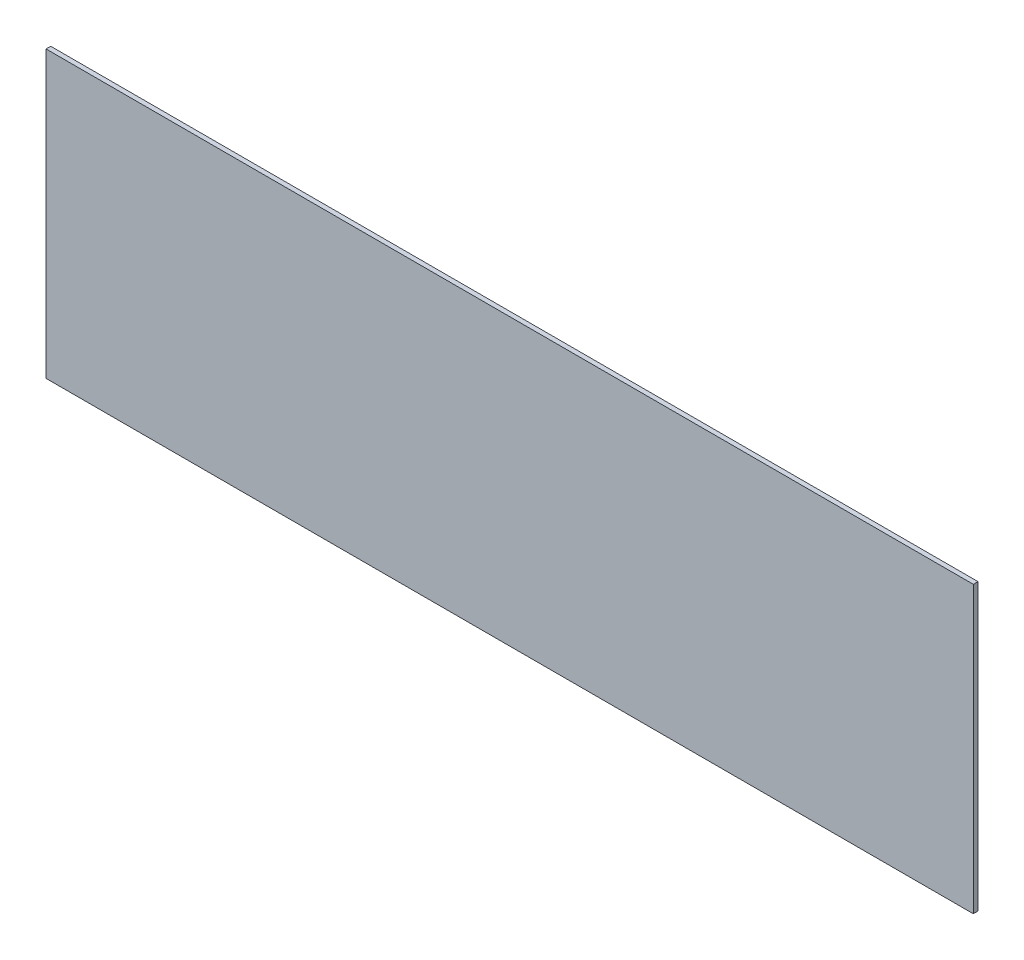
ISO-10303-21;
HEADER;
FILE_DESCRIPTION(('STEP AP214'),'2;1');
FILE_NAME('part.step','',(''),(''),'','','');
FILE_SCHEMA(('AUTOMOTIVE_DESIGN { 1 0 10303 214 1 1 1 1 }'));
ENDSEC;
DATA;
#1=APPLICATION_CONTEXT('core data for automotive mechanical design processes');
#2=APPLICATION_PROTOCOL_DEFINITION('international standard','automotive_design',2000,#1);
#3=PRODUCT_CONTEXT('',#1,'mechanical');
#4=PRODUCT('Part','Part','',(#3));
#5=PRODUCT_RELATED_PRODUCT_CATEGORY('part','',(#4));
#6=PRODUCT_DEFINITION_FORMATION('','',#4);
#7=PRODUCT_DEFINITION_CONTEXT('part definition',#1,'design');
#8=PRODUCT_DEFINITION('design','',#6,#7);
#9=PRODUCT_DEFINITION_SHAPE('','',#8);
#10=(LENGTH_UNIT() NAMED_UNIT(*) SI_UNIT(.MILLI.,.METRE.));
#11=(NAMED_UNIT(*) PLANE_ANGLE_UNIT() SI_UNIT($,.RADIAN.));
#12=(NAMED_UNIT(*) SI_UNIT($,.STERADIAN.) SOLID_ANGLE_UNIT());
#13=UNCERTAINTY_MEASURE_WITH_UNIT(LENGTH_MEASURE(1.E-05),#10,'distance_accuracy_value','');
#14=(GEOMETRIC_REPRESENTATION_CONTEXT(3) GLOBAL_UNCERTAINTY_ASSIGNED_CONTEXT((#13)) GLOBAL_UNIT_ASSIGNED_CONTEXT((#10,
#11,#12)) REPRESENTATION_CONTEXT('',''));
#15=CARTESIAN_POINT('',(0.,0.,0.));
#16=DIRECTION('',(0.,0.,1.));
#17=DIRECTION('',(1.,0.,0.));
#18=AXIS2_PLACEMENT_3D('',#15,#16,#17);
#19=CARTESIAN_POINT('',(0.,0.,0.41656));
#20=DIRECTION('',(0.,0.,1.));
#21=DIRECTION('',(1.,0.,0.));
#22=AXIS2_PLACEMENT_3D('',#19,#20,#21);
#23=PLANE('',#22);
#24=DIRECTION('',(1.,0.,0.));
#25=VECTOR('',#24,1.);
#26=CARTESIAN_POINT('',(0.,25.4,0.41656));
#27=LINE('',#26,#25);
#28=CARTESIAN_POINT('',(0.,25.4,0.41656));
#29=VERTEX_POINT('',#28);
#30=CARTESIAN_POINT('',(82.55,25.4,0.41656));
#31=VERTEX_POINT('',#30);
#32=EDGE_CURVE('E53',#29,#31,#27,.T.);
#33=ORIENTED_EDGE('',*,*,#32,.F.);
#34=DIRECTION('',(0.,1.,0.));
#35=VECTOR('',#34,1.);
#36=CARTESIAN_POINT('',(0.,0.,0.41656));
#37=LINE('',#36,#35);
#38=CARTESIAN_POINT('',(0.,0.,0.41656));
#39=VERTEX_POINT('',#38);
#40=EDGE_CURVE('E68',#39,#29,#37,.T.);
#41=ORIENTED_EDGE('',*,*,#40,.F.);
#42=DIRECTION('',(1.,0.,0.));
#43=VECTOR('',#42,1.);
#44=CARTESIAN_POINT('',(82.55,0.,0.41656));
#45=LINE('',#44,#43);
#46=CARTESIAN_POINT('',(82.55,0.,0.41656));
#47=VERTEX_POINT('',#46);
#48=EDGE_CURVE('E20',#47,#39,#45,.F.);
#49=ORIENTED_EDGE('',*,*,#48,.F.);
#50=DIRECTION('',(0.,1.,0.));
#51=VECTOR('',#50,1.);
#52=CARTESIAN_POINT('',(82.55,25.4,0.41656));
#53=LINE('',#52,#51);
#54=EDGE_CURVE('E58',#31,#47,#53,.F.);
#55=ORIENTED_EDGE('',*,*,#54,.F.);
#56=EDGE_LOOP('',(#33,#41,#49,#55));
#57=FACE_BOUND('',#56,.T.);
#58=ADVANCED_FACE('F17',(#57),#23,.T.);
#59=CARTESIAN_POINT('',(82.55,0.,0.));
#60=DIRECTION('',(0.,-1.,0.));
#61=DIRECTION('',(0.,0.,-1.));
#62=AXIS2_PLACEMENT_3D('',#59,#60,#61);
#63=PLANE('',#62);
#64=DIRECTION('',(0.,0.,1.));
#65=VECTOR('',#64,1.);
#66=CARTESIAN_POINT('',(0.,0.,0.));
#67=LINE('',#66,#65);
#68=CARTESIAN_POINT('',(0.,0.,0.));
#69=VERTEX_POINT('',#68);
#70=EDGE_CURVE('E79',#69,#39,#67,.T.);
#71=ORIENTED_EDGE('',*,*,#70,.F.);
#72=DIRECTION('',(1.,0.,0.));
#73=VECTOR('',#72,1.);
#74=CARTESIAN_POINT('',(0.,0.,0.));
#75=LINE('',#74,#73);
#76=CARTESIAN_POINT('',(82.55,0.,0.));
#77=VERTEX_POINT('',#76);
#78=EDGE_CURVE('E74',#69,#77,#75,.T.);
#79=ORIENTED_EDGE('',*,*,#78,.T.);
#80=DIRECTION('',(0.,0.,-1.));
#81=VECTOR('',#80,1.);
#82=CARTESIAN_POINT('',(82.55,0.,0.));
#83=LINE('',#82,#81);
#84=EDGE_CURVE('E63',#47,#77,#83,.T.);
#85=ORIENTED_EDGE('',*,*,#84,.F.);
#86=ORIENTED_EDGE('',*,*,#48,.T.);
#87=EDGE_LOOP('',(#71,#79,#85,#86));
#88=FACE_BOUND('',#87,.T.);
#89=ADVANCED_FACE('F73',(#88),#63,.T.);
#90=CARTESIAN_POINT('',(82.55,25.4,0.));
#91=DIRECTION('',(1.,0.,0.));
#92=DIRECTION('',(0.,0.,-1.));
#93=AXIS2_PLACEMENT_3D('',#90,#91,#92);
#94=PLANE('',#93);
#95=ORIENTED_EDGE('',*,*,#84,.T.);
#96=DIRECTION('',(0.,1.,0.));
#97=VECTOR('',#96,1.);
#98=CARTESIAN_POINT('',(82.55,0.,0.));
#99=LINE('',#98,#97);
#100=CARTESIAN_POINT('',(82.55,25.4,0.));
#101=VERTEX_POINT('',#100);
#102=EDGE_CURVE('E84',#77,#101,#99,.T.);
#103=ORIENTED_EDGE('',*,*,#102,.T.);
#104=DIRECTION('',(0.,0.,1.));
#105=VECTOR('',#104,1.);
#106=CARTESIAN_POINT('',(82.55,25.4,0.));
#107=LINE('',#106,#105);
#108=EDGE_CURVE('E65',#31,#101,#107,.F.);
#109=ORIENTED_EDGE('',*,*,#108,.F.);
#110=ORIENTED_EDGE('',*,*,#54,.T.);
#111=EDGE_LOOP('',(#95,#103,#109,#110));
#112=FACE_BOUND('',#111,.T.);
#113=ADVANCED_FACE('F60',(#112),#94,.T.);
#114=CARTESIAN_POINT('',(0.,25.4,0.));
#115=DIRECTION('',(0.,1.,0.));
#116=DIRECTION('',(0.,0.,1.));
#117=AXIS2_PLACEMENT_3D('',#114,#115,#116);
#118=PLANE('',#117);
#119=ORIENTED_EDGE('',*,*,#108,.T.);
#120=DIRECTION('',(1.,0.,0.));
#121=VECTOR('',#120,1.);
#122=CARTESIAN_POINT('',(0.,25.4,0.));
#123=LINE('',#122,#121);
#124=CARTESIAN_POINT('',(0.,25.4,0.));
#125=VERTEX_POINT('',#124);
#126=EDGE_CURVE('E26',#101,#125,#123,.F.);
#127=ORIENTED_EDGE('',*,*,#126,.T.);
#128=DIRECTION('',(0.,0.,1.));
#129=VECTOR('',#128,1.);
#130=CARTESIAN_POINT('',(0.,25.4,0.));
#131=LINE('',#130,#129);
#132=EDGE_CURVE('E34',#29,#125,#131,.F.);
#133=ORIENTED_EDGE('',*,*,#132,.F.);
#134=ORIENTED_EDGE('',*,*,#32,.T.);
#135=EDGE_LOOP('',(#119,#127,#133,#134));
#136=FACE_BOUND('',#135,.T.);
#137=ADVANCED_FACE('F88',(#136),#118,.T.);
#138=CARTESIAN_POINT('',(0.,0.,0.));
#139=DIRECTION('',(-1.,0.,0.));
#140=DIRECTION('',(0.,0.,1.));
#141=AXIS2_PLACEMENT_3D('',#138,#139,#140);
#142=PLANE('',#141);
#143=ORIENTED_EDGE('',*,*,#132,.T.);
#144=DIRECTION('',(0.,1.,0.));
#145=VECTOR('',#144,1.);
#146=CARTESIAN_POINT('',(0.,0.,0.));
#147=LINE('',#146,#145);
#148=EDGE_CURVE('E11',#125,#69,#147,.F.);
#149=ORIENTED_EDGE('',*,*,#148,.T.);
#150=ORIENTED_EDGE('',*,*,#70,.T.);
#151=ORIENTED_EDGE('',*,*,#40,.T.);
#152=EDGE_LOOP('',(#143,#149,#150,#151));
#153=FACE_BOUND('',#152,.T.);
#154=ADVANCED_FACE('F91',(#153),#142,.T.);
#155=CARTESIAN_POINT('',(0.,0.,0.));
#156=DIRECTION('',(0.,0.,1.));
#157=DIRECTION('',(1.,0.,0.));
#158=AXIS2_PLACEMENT_3D('',#155,#156,#157);
#159=PLANE('',#158);
#160=ORIENTED_EDGE('',*,*,#126,.F.);
#161=ORIENTED_EDGE('',*,*,#102,.F.);
#162=ORIENTED_EDGE('',*,*,#78,.F.);
#163=ORIENTED_EDGE('',*,*,#148,.F.);
#164=EDGE_LOOP('',(#160,#161,#162,#163));
#165=FACE_BOUND('',#164,.T.);
#166=ADVANCED_FACE('F90',(#165),#159,.F.);
#167=CLOSED_SHELL('',(#58,#89,#113,#137,#154,#166));
#168=MANIFOLD_SOLID_BREP('B1',#167);
#169=ADVANCED_BREP_SHAPE_REPRESENTATION('',(#18,#168),#14);
#170=SHAPE_DEFINITION_REPRESENTATION(#9,#169);
ENDSEC;
END-ISO-10303-21;
